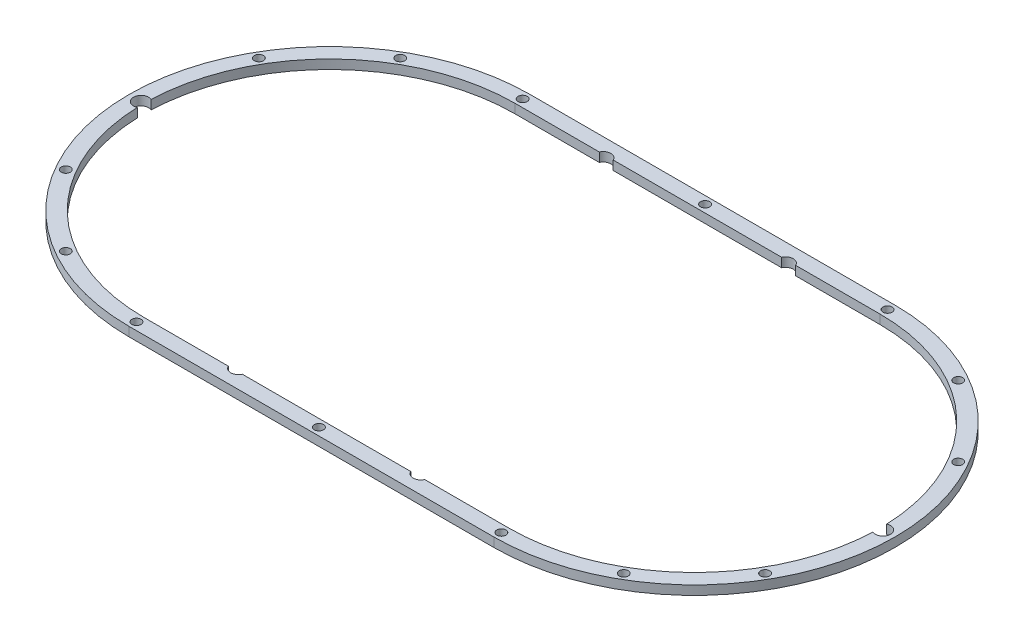
ISO-10303-21;
HEADER;
FILE_DESCRIPTION(('STEP AP214'),'2;1');
FILE_NAME('part.step','',(''),(''),'','','');
FILE_SCHEMA(('AUTOMOTIVE_DESIGN { 1 0 10303 214 1 1 1 1 }'));
ENDSEC;
DATA;
#1=APPLICATION_CONTEXT('core data for automotive mechanical design processes');
#2=APPLICATION_PROTOCOL_DEFINITION('international standard','automotive_design',2000,#1);
#3=PRODUCT_CONTEXT('',#1,'mechanical');
#4=PRODUCT('Part','Part','',(#3));
#5=PRODUCT_RELATED_PRODUCT_CATEGORY('part','',(#4));
#6=PRODUCT_DEFINITION_FORMATION('','',#4);
#7=PRODUCT_DEFINITION_CONTEXT('part definition',#1,'design');
#8=PRODUCT_DEFINITION('design','',#6,#7);
#9=PRODUCT_DEFINITION_SHAPE('','',#8);
#10=(LENGTH_UNIT() NAMED_UNIT(*) SI_UNIT(.MILLI.,.METRE.));
#11=(NAMED_UNIT(*) PLANE_ANGLE_UNIT() SI_UNIT($,.RADIAN.));
#12=(NAMED_UNIT(*) SI_UNIT($,.STERADIAN.) SOLID_ANGLE_UNIT());
#13=UNCERTAINTY_MEASURE_WITH_UNIT(LENGTH_MEASURE(1.E-05),#10,'distance_accuracy_value','');
#14=(GEOMETRIC_REPRESENTATION_CONTEXT(3) GLOBAL_UNCERTAINTY_ASSIGNED_CONTEXT((#13)) GLOBAL_UNIT_ASSIGNED_CONTEXT((#10,
#11,#12)) REPRESENTATION_CONTEXT('',''));
#15=CARTESIAN_POINT('',(0.,0.,0.));
#16=DIRECTION('',(0.,0.,1.));
#17=DIRECTION('',(1.,0.,0.));
#18=AXIS2_PLACEMENT_3D('',#15,#16,#17);
#19=CARTESIAN_POINT('',(0.,3.,0.));
#20=DIRECTION('',(0.,1.,0.));
#21=DIRECTION('',(0.,0.,1.));
#22=AXIS2_PLACEMENT_3D('',#19,#20,#21);
#23=PLANE('',#22);
#24=CARTESIAN_POINT('',(-30.,3.,-60.));
#25=DIRECTION('',(0.,1.,0.));
#26=DIRECTION('',(0.,0.,1.));
#27=AXIS2_PLACEMENT_3D('',#24,#25,#26);
#28=CIRCLE('',#27,2.5);
#29=CARTESIAN_POINT('',(-27.7087121525221,3.,-61.));
#30=VERTEX_POINT('',#29);
#31=CARTESIAN_POINT('',(-32.2912878474779,3.,-61.));
#32=VERTEX_POINT('',#31);
#33=EDGE_CURVE('E58',#30,#32,#28,.T.);
#34=ORIENTED_EDGE('',*,*,#33,.F.);
#35=DIRECTION('',(-1.,0.,0.));
#36=VECTOR('',#35,1.);
#37=CARTESIAN_POINT('',(27.7087121525221,3.,-61.));
#38=LINE('',#37,#36);
#39=CARTESIAN_POINT('',(27.7087121525221,3.,-61.));
#40=VERTEX_POINT('',#39);
#41=EDGE_CURVE('E252',#40,#30,#38,.T.);
#42=ORIENTED_EDGE('',*,*,#41,.F.);
#43=CARTESIAN_POINT('',(30.,3.,-60.));
#44=DIRECTION('',(0.,1.,0.));
#45=DIRECTION('',(0.,0.,1.));
#46=AXIS2_PLACEMENT_3D('',#43,#44,#45);
#47=CIRCLE('',#46,2.5);
#48=CARTESIAN_POINT('',(32.2912878474779,3.,-61.));
#49=VERTEX_POINT('',#48);
#50=EDGE_CURVE('E248',#49,#40,#47,.T.);
#51=ORIENTED_EDGE('',*,*,#50,.F.);
#52=DIRECTION('',(-1.,0.,0.));
#53=VECTOR('',#52,1.);
#54=CARTESIAN_POINT('',(60.,3.,-61.));
#55=LINE('',#54,#53);
#56=CARTESIAN_POINT('',(60.,3.,-61.));
#57=VERTEX_POINT('',#56);
#58=EDGE_CURVE('E244',#57,#49,#55,.T.);
#59=ORIENTED_EDGE('',*,*,#58,.F.);
#60=CARTESIAN_POINT('',(60.,3.,0.));
#61=DIRECTION('',(0.,1.,0.));
#62=DIRECTION('',(0.,0.,1.));
#63=AXIS2_PLACEMENT_3D('',#60,#61,#62);
#64=CIRCLE('',#63,61.);
#65=CARTESIAN_POINT('',(120.957661290323,3.,-2.27234020655112));
#66=VERTEX_POINT('',#65);
#67=EDGE_CURVE('E240',#66,#57,#64,.T.);
#68=ORIENTED_EDGE('',*,*,#67,.F.);
#69=CARTESIAN_POINT('',(122.,3.,0.));
#70=DIRECTION('',(0.,1.,0.));
#71=DIRECTION('',(0.,0.,1.));
#72=AXIS2_PLACEMENT_3D('',#69,#70,#71);
#73=CIRCLE('',#72,2.50000000000016);
#74=CARTESIAN_POINT('',(120.957661290323,3.,2.27234020655112));
#75=VERTEX_POINT('',#74);
#76=EDGE_CURVE('E236',#75,#66,#73,.T.);
#77=ORIENTED_EDGE('',*,*,#76,.F.);
#78=CARTESIAN_POINT('',(60.,3.,0.));
#79=DIRECTION('',(0.,1.,0.));
#80=DIRECTION('',(0.,0.,1.));
#81=AXIS2_PLACEMENT_3D('',#78,#79,#80);
#82=CIRCLE('',#81,61.);
#83=CARTESIAN_POINT('',(60.,3.,61.));
#84=VERTEX_POINT('',#83);
#85=EDGE_CURVE('E232',#84,#75,#82,.T.);
#86=ORIENTED_EDGE('',*,*,#85,.F.);
#87=DIRECTION('',(1.,0.,0.));
#88=VECTOR('',#87,1.);
#89=CARTESIAN_POINT('',(32.2912878474779,3.,61.));
#90=LINE('',#89,#88);
#91=CARTESIAN_POINT('',(32.2912878474779,3.,61.));
#92=VERTEX_POINT('',#91);
#93=EDGE_CURVE('E228',#92,#84,#90,.T.);
#94=ORIENTED_EDGE('',*,*,#93,.F.);
#95=CARTESIAN_POINT('',(30.,3.,60.));
#96=DIRECTION('',(0.,1.,0.));
#97=DIRECTION('',(0.,0.,1.));
#98=AXIS2_PLACEMENT_3D('',#95,#96,#97);
#99=CIRCLE('',#98,2.5);
#100=CARTESIAN_POINT('',(27.7087121525221,3.,61.));
#101=VERTEX_POINT('',#100);
#102=EDGE_CURVE('E224',#101,#92,#99,.T.);
#103=ORIENTED_EDGE('',*,*,#102,.F.);
#104=DIRECTION('',(1.,0.,0.));
#105=VECTOR('',#104,1.);
#106=CARTESIAN_POINT('',(-27.7087121525221,3.,61.));
#107=LINE('',#106,#105);
#108=CARTESIAN_POINT('',(-27.7087121525221,3.,61.));
#109=VERTEX_POINT('',#108);
#110=EDGE_CURVE('E220',#109,#101,#107,.T.);
#111=ORIENTED_EDGE('',*,*,#110,.F.);
#112=CARTESIAN_POINT('',(-30.,3.,60.));
#113=DIRECTION('',(0.,1.,0.));
#114=DIRECTION('',(0.,0.,1.));
#115=AXIS2_PLACEMENT_3D('',#112,#113,#114);
#116=CIRCLE('',#115,2.5);
#117=CARTESIAN_POINT('',(-32.2912878474779,3.,61.));
#118=VERTEX_POINT('',#117);
#119=EDGE_CURVE('E216',#118,#109,#116,.T.);
#120=ORIENTED_EDGE('',*,*,#119,.F.);
#121=DIRECTION('',(1.,0.,0.));
#122=VECTOR('',#121,1.);
#123=CARTESIAN_POINT('',(-60.,3.,61.));
#124=LINE('',#123,#122);
#125=CARTESIAN_POINT('',(-60.,3.,61.));
#126=VERTEX_POINT('',#125);
#127=EDGE_CURVE('E212',#126,#118,#124,.T.);
#128=ORIENTED_EDGE('',*,*,#127,.F.);
#129=CARTESIAN_POINT('',(-60.,3.,0.));
#130=DIRECTION('',(0.,1.,0.));
#131=DIRECTION('',(0.,0.,1.));
#132=AXIS2_PLACEMENT_3D('',#129,#130,#131);
#133=CIRCLE('',#132,61.);
#134=CARTESIAN_POINT('',(-120.957661290323,3.,2.2723402065511));
#135=VERTEX_POINT('',#134);
#136=EDGE_CURVE('E205',#135,#126,#133,.T.);
#137=ORIENTED_EDGE('',*,*,#136,.F.);
#138=CARTESIAN_POINT('',(-122.,3.,0.));
#139=DIRECTION('',(0.,1.,0.));
#140=DIRECTION('',(0.,0.,1.));
#141=AXIS2_PLACEMENT_3D('',#138,#139,#140);
#142=CIRCLE('',#141,2.50000000000016);
#143=CARTESIAN_POINT('',(-120.957661290323,3.,-2.27234020655112));
#144=VERTEX_POINT('',#143);
#145=EDGE_CURVE('E201',#144,#135,#142,.T.);
#146=ORIENTED_EDGE('',*,*,#145,.F.);
#147=CARTESIAN_POINT('',(-60.,3.,0.));
#148=DIRECTION('',(0.,1.,0.));
#149=DIRECTION('',(0.,0.,1.));
#150=AXIS2_PLACEMENT_3D('',#147,#148,#149);
#151=CIRCLE('',#150,61.);
#152=CARTESIAN_POINT('',(-60.,3.,-61.));
#153=VERTEX_POINT('',#152);
#154=EDGE_CURVE('E183',#153,#144,#151,.T.);
#155=ORIENTED_EDGE('',*,*,#154,.F.);
#156=DIRECTION('',(-1.,0.,0.));
#157=VECTOR('',#156,1.);
#158=CARTESIAN_POINT('',(-32.2912878474779,3.,-61.));
#159=LINE('',#158,#157);
#160=EDGE_CURVE('E193',#32,#153,#159,.T.);
#161=ORIENTED_EDGE('',*,*,#160,.F.);
#162=EDGE_LOOP('',(#34,#42,#51,#59,#68,#77,#86,#94,#103,#111,#120,#128,#137,#146,#155,#161));
#163=FACE_BOUND('',#162,.T.);
#164=CARTESIAN_POINT('',(91.7500000000002,3.,-54.9926131403117));
#165=DIRECTION('',(0.,1.,0.));
#166=DIRECTION('',(0.,0.,1.));
#167=AXIS2_PLACEMENT_3D('',#164,#165,#166);
#168=CIRCLE('',#167,1.5);
#169=CARTESIAN_POINT('',(91.7500000000002,3.,-53.4926131403117));
#170=VERTEX_POINT('',#169);
#171=EDGE_CURVE('E325',#170,#170,#168,.T.);
#172=ORIENTED_EDGE('',*,*,#171,.F.);
#173=EDGE_LOOP('',(#172));
#174=FACE_BOUND('',#173,.T.);
#175=CARTESIAN_POINT('',(60.,3.,-63.4999999999999));
#176=DIRECTION('',(0.,1.,0.));
#177=DIRECTION('',(0.,0.,1.));
#178=AXIS2_PLACEMENT_3D('',#175,#176,#177);
#179=CIRCLE('',#178,1.5);
#180=CARTESIAN_POINT('',(60.,3.,-61.9999999999999));
#181=VERTEX_POINT('',#180);
#182=EDGE_CURVE('E320',#181,#181,#179,.T.);
#183=ORIENTED_EDGE('',*,*,#182,.F.);
#184=EDGE_LOOP('',(#183));
#185=FACE_BOUND('',#184,.T.);
#186=CARTESIAN_POINT('',(114.992613140312,3.,-31.7499999999997));
#187=DIRECTION('',(0.,1.,0.));
#188=DIRECTION('',(0.,0.,1.));
#189=AXIS2_PLACEMENT_3D('',#186,#187,#188);
#190=CIRCLE('',#189,1.5);
#191=CARTESIAN_POINT('',(114.992613140312,3.,-30.2499999999997));
#192=VERTEX_POINT('',#191);
#193=EDGE_CURVE('E324',#192,#192,#190,.T.);
#194=ORIENTED_EDGE('',*,*,#193,.F.);
#195=EDGE_LOOP('',(#194));
#196=FACE_BOUND('',#195,.T.);
#197=CARTESIAN_POINT('',(0.,3.,-63.4999999999999));
#198=DIRECTION('',(0.,1.,0.));
#199=DIRECTION('',(0.,0.,1.));
#200=AXIS2_PLACEMENT_3D('',#197,#198,#199);
#201=CIRCLE('',#200,1.5);
#202=CARTESIAN_POINT('',(0.,3.,-61.9999999999999));
#203=VERTEX_POINT('',#202);
#204=EDGE_CURVE('E330',#203,#203,#201,.T.);
#205=ORIENTED_EDGE('',*,*,#204,.F.);
#206=EDGE_LOOP('',(#205));
#207=FACE_BOUND('',#206,.T.);
#208=CARTESIAN_POINT('',(91.7500000000002,3.,54.9926131403117));
#209=DIRECTION('',(0.,1.,0.));
#210=DIRECTION('',(0.,0.,-1.));
#211=AXIS2_PLACEMENT_3D('',#208,#209,#210);
#212=CIRCLE('',#211,1.5);
#213=CARTESIAN_POINT('',(91.7500000000002,3.,53.4926131403117));
#214=VERTEX_POINT('',#213);
#215=EDGE_CURVE('E329',#214,#214,#212,.T.);
#216=ORIENTED_EDGE('',*,*,#215,.F.);
#217=EDGE_LOOP('',(#216));
#218=FACE_BOUND('',#217,.T.);
#219=CARTESIAN_POINT('',(114.992613140312,3.,31.7499999999997));
#220=DIRECTION('',(0.,1.,0.));
#221=DIRECTION('',(0.,0.,-1.));
#222=AXIS2_PLACEMENT_3D('',#219,#220,#221);
#223=CIRCLE('',#222,1.5);
#224=CARTESIAN_POINT('',(114.992613140312,3.,30.2499999999997));
#225=VERTEX_POINT('',#224);
#226=EDGE_CURVE('E341',#225,#225,#223,.T.);
#227=ORIENTED_EDGE('',*,*,#226,.F.);
#228=EDGE_LOOP('',(#227));
#229=FACE_BOUND('',#228,.T.);
#230=CARTESIAN_POINT('',(-91.7500000000002,3.,54.9926131403117));
#231=DIRECTION('',(0.,1.,0.));
#232=DIRECTION('',(0.,0.,1.));
#233=AXIS2_PLACEMENT_3D('',#230,#231,#232);
#234=CIRCLE('',#233,1.5);
#235=CARTESIAN_POINT('',(-91.7500000000002,3.,56.4926131403117));
#236=VERTEX_POINT('',#235);
#237=EDGE_CURVE('E345',#236,#236,#234,.T.);
#238=ORIENTED_EDGE('',*,*,#237,.F.);
#239=EDGE_LOOP('',(#238));
#240=FACE_BOUND('',#239,.T.);
#241=CARTESIAN_POINT('',(-114.992613140312,3.,31.7499999999997));
#242=DIRECTION('',(0.,1.,0.));
#243=DIRECTION('',(0.,0.,1.));
#244=AXIS2_PLACEMENT_3D('',#241,#242,#243);
#245=CIRCLE('',#244,1.5);
#246=CARTESIAN_POINT('',(-114.992613140312,3.,33.2499999999997));
#247=VERTEX_POINT('',#246);
#248=EDGE_CURVE('E308',#247,#247,#245,.T.);
#249=ORIENTED_EDGE('',*,*,#248,.F.);
#250=EDGE_LOOP('',(#249));
#251=FACE_BOUND('',#250,.T.);
#252=CARTESIAN_POINT('',(-60.,3.,63.4999999999999));
#253=DIRECTION('',(0.,1.,0.));
#254=DIRECTION('',(0.,0.,-1.));
#255=AXIS2_PLACEMENT_3D('',#252,#253,#254);
#256=CIRCLE('',#255,1.5);
#257=CARTESIAN_POINT('',(-60.,3.,61.9999999999999));
#258=VERTEX_POINT('',#257);
#259=EDGE_CURVE('E259',#258,#258,#256,.T.);
#260=ORIENTED_EDGE('',*,*,#259,.F.);
#261=EDGE_LOOP('',(#260));
#262=FACE_BOUND('',#261,.T.);
#263=CARTESIAN_POINT('',(0.,3.,63.4999999999999));
#264=DIRECTION('',(0.,1.,0.));
#265=DIRECTION('',(0.,0.,-1.));
#266=AXIS2_PLACEMENT_3D('',#263,#264,#265);
#267=CIRCLE('',#266,1.5);
#268=CARTESIAN_POINT('',(0.,3.,61.9999999999999));
#269=VERTEX_POINT('',#268);
#270=EDGE_CURVE('E303',#269,#269,#267,.T.);
#271=ORIENTED_EDGE('',*,*,#270,.F.);
#272=EDGE_LOOP('',(#271));
#273=FACE_BOUND('',#272,.T.);
#274=CARTESIAN_POINT('',(60.,3.,63.4999999999999));
#275=DIRECTION('',(0.,1.,0.));
#276=DIRECTION('',(0.,0.,-1.));
#277=AXIS2_PLACEMENT_3D('',#274,#275,#276);
#278=CIRCLE('',#277,1.5);
#279=CARTESIAN_POINT('',(60.,3.,61.9999999999999));
#280=VERTEX_POINT('',#279);
#281=EDGE_CURVE('E313',#280,#280,#278,.T.);
#282=ORIENTED_EDGE('',*,*,#281,.F.);
#283=EDGE_LOOP('',(#282));
#284=FACE_BOUND('',#283,.T.);
#285=CARTESIAN_POINT('',(-114.992613140312,3.,-31.7499999999997));
#286=DIRECTION('',(0.,1.,0.));
#287=DIRECTION('',(0.,0.,-1.));
#288=AXIS2_PLACEMENT_3D('',#285,#286,#287);
#289=CIRCLE('',#288,1.5);
#290=CARTESIAN_POINT('',(-114.992613140312,3.,-33.2499999999997));
#291=VERTEX_POINT('',#290);
#292=EDGE_CURVE('E309',#291,#291,#289,.T.);
#293=ORIENTED_EDGE('',*,*,#292,.F.);
#294=EDGE_LOOP('',(#293));
#295=FACE_BOUND('',#294,.T.);
#296=CARTESIAN_POINT('',(-91.7500000000002,3.,-54.9926131403117));
#297=DIRECTION('',(0.,1.,0.));
#298=DIRECTION('',(0.,0.,-1.));
#299=AXIS2_PLACEMENT_3D('',#296,#297,#298);
#300=CIRCLE('',#299,1.5);
#301=CARTESIAN_POINT('',(-91.7500000000002,3.,-56.4926131403117));
#302=VERTEX_POINT('',#301);
#303=EDGE_CURVE('E304',#302,#302,#300,.T.);
#304=ORIENTED_EDGE('',*,*,#303,.F.);
#305=EDGE_LOOP('',(#304));
#306=FACE_BOUND('',#305,.T.);
#307=CARTESIAN_POINT('',(-60.,3.,-63.4999999999999));
#308=DIRECTION('',(0.,1.,0.));
#309=DIRECTION('',(0.,0.,1.));
#310=AXIS2_PLACEMENT_3D('',#307,#308,#309);
#311=CIRCLE('',#310,1.5);
#312=CARTESIAN_POINT('',(-60.,3.,-61.9999999999999));
#313=VERTEX_POINT('',#312);
#314=EDGE_CURVE('E334',#313,#313,#311,.T.);
#315=ORIENTED_EDGE('',*,*,#314,.F.);
#316=EDGE_LOOP('',(#315));
#317=FACE_BOUND('',#316,.T.);
#318=DIRECTION('',(-1.,0.,0.));
#319=VECTOR('',#318,1.);
#320=CARTESIAN_POINT('',(60.,3.,-66.));
#321=LINE('',#320,#319);
#322=CARTESIAN_POINT('',(60.,3.,-66.));
#323=VERTEX_POINT('',#322);
#324=CARTESIAN_POINT('',(-60.,3.,-66.));
#325=VERTEX_POINT('',#324);
#326=EDGE_CURVE('E369',#323,#325,#321,.T.);
#327=ORIENTED_EDGE('',*,*,#326,.T.);
#328=CARTESIAN_POINT('',(-60.,3.,0.));
#329=DIRECTION('',(0.,1.,0.));
#330=DIRECTION('',(0.,0.,1.));
#331=AXIS2_PLACEMENT_3D('',#328,#329,#330);
#332=CIRCLE('',#331,66.);
#333=CARTESIAN_POINT('',(-60.,3.,66.));
#334=VERTEX_POINT('',#333);
#335=EDGE_CURVE('E356',#325,#334,#332,.T.);
#336=ORIENTED_EDGE('',*,*,#335,.T.);
#337=DIRECTION('',(1.,0.,0.));
#338=VECTOR('',#337,1.);
#339=CARTESIAN_POINT('',(-60.,3.,66.));
#340=LINE('',#339,#338);
#341=CARTESIAN_POINT('',(60.,3.,66.));
#342=VERTEX_POINT('',#341);
#343=EDGE_CURVE('E360',#334,#342,#340,.T.);
#344=ORIENTED_EDGE('',*,*,#343,.T.);
#345=CARTESIAN_POINT('',(60.,3.,0.));
#346=DIRECTION('',(0.,1.,0.));
#347=DIRECTION('',(0.,0.,1.));
#348=AXIS2_PLACEMENT_3D('',#345,#346,#347);
#349=CIRCLE('',#348,66.);
#350=EDGE_CURVE('E365',#342,#323,#349,.T.);
#351=ORIENTED_EDGE('',*,*,#350,.T.);
#352=EDGE_LOOP('',(#327,#336,#344,#351));
#353=FACE_BOUND('',#352,.T.);
#354=ADVANCED_FACE('F42',(#163,#174,#185,#196,#207,#218,#229,#240,#251,#262,#273,#284,#295,#306,
#317,#353),#23,.T.);
#355=CARTESIAN_POINT('',(0.,0.,0.));
#356=DIRECTION('',(0.,1.,0.));
#357=DIRECTION('',(0.,0.,1.));
#358=AXIS2_PLACEMENT_3D('',#355,#356,#357);
#359=PLANE('',#358);
#360=DIRECTION('',(-1.,0.,0.));
#361=VECTOR('',#360,1.);
#362=CARTESIAN_POINT('',(0.,0.,-61.));
#363=LINE('',#362,#361);
#364=CARTESIAN_POINT('',(27.7087121525221,0.,-61.));
#365=VERTEX_POINT('',#364);
#366=CARTESIAN_POINT('',(-27.7087121525221,0.,-61.));
#367=VERTEX_POINT('',#366);
#368=EDGE_CURVE('E51',#365,#367,#363,.T.);
#369=ORIENTED_EDGE('',*,*,#368,.T.);
#370=CARTESIAN_POINT('',(-30.,0.,-60.));
#371=DIRECTION('',(0.,1.,0.));
#372=DIRECTION('',(0.,0.,1.));
#373=AXIS2_PLACEMENT_3D('',#370,#371,#372);
#374=CIRCLE('',#373,2.5);
#375=CARTESIAN_POINT('',(-32.2912878474779,0.,-61.));
#376=VERTEX_POINT('',#375);
#377=EDGE_CURVE('E11',#367,#376,#374,.T.);
#378=ORIENTED_EDGE('',*,*,#377,.T.);
#379=DIRECTION('',(-1.,0.,0.));
#380=VECTOR('',#379,1.);
#381=CARTESIAN_POINT('',(0.,0.,-61.));
#382=LINE('',#381,#380);
#383=CARTESIAN_POINT('',(-60.,0.,-61.));
#384=VERTEX_POINT('',#383);
#385=EDGE_CURVE('E399',#376,#384,#382,.T.);
#386=ORIENTED_EDGE('',*,*,#385,.T.);
#387=CARTESIAN_POINT('',(-60.,0.,0.));
#388=DIRECTION('',(0.,1.,0.));
#389=DIRECTION('',(0.,0.,1.));
#390=AXIS2_PLACEMENT_3D('',#387,#388,#389);
#391=CIRCLE('',#390,61.);
#392=CARTESIAN_POINT('',(-120.957661290323,0.,-2.27234020655112));
#393=VERTEX_POINT('',#392);
#394=EDGE_CURVE('E186',#384,#393,#391,.T.);
#395=ORIENTED_EDGE('',*,*,#394,.T.);
#396=CARTESIAN_POINT('',(-122.,0.,0.));
#397=DIRECTION('',(0.,1.,0.));
#398=DIRECTION('',(0.,0.,1.));
#399=AXIS2_PLACEMENT_3D('',#396,#397,#398);
#400=CIRCLE('',#399,2.50000000000016);
#401=CARTESIAN_POINT('',(-120.957661290323,0.,2.2723402065511));
#402=VERTEX_POINT('',#401);
#403=EDGE_CURVE('E458',#393,#402,#400,.T.);
#404=ORIENTED_EDGE('',*,*,#403,.T.);
#405=CARTESIAN_POINT('',(-60.,0.,0.));
#406=DIRECTION('',(0.,1.,0.));
#407=DIRECTION('',(0.,0.,1.));
#408=AXIS2_PLACEMENT_3D('',#405,#406,#407);
#409=CIRCLE('',#408,61.);
#410=CARTESIAN_POINT('',(-60.,0.,61.));
#411=VERTEX_POINT('',#410);
#412=EDGE_CURVE('E462',#402,#411,#409,.T.);
#413=ORIENTED_EDGE('',*,*,#412,.T.);
#414=DIRECTION('',(1.,0.,0.));
#415=VECTOR('',#414,1.);
#416=CARTESIAN_POINT('',(0.,0.,61.));
#417=LINE('',#416,#415);
#418=CARTESIAN_POINT('',(-32.2912878474779,0.,61.));
#419=VERTEX_POINT('',#418);
#420=EDGE_CURVE('E466',#411,#419,#417,.T.);
#421=ORIENTED_EDGE('',*,*,#420,.T.);
#422=CARTESIAN_POINT('',(-30.,0.,60.));
#423=DIRECTION('',(0.,1.,0.));
#424=DIRECTION('',(0.,0.,1.));
#425=AXIS2_PLACEMENT_3D('',#422,#423,#424);
#426=CIRCLE('',#425,2.5);
#427=CARTESIAN_POINT('',(-27.7087121525221,0.,61.));
#428=VERTEX_POINT('',#427);
#429=EDGE_CURVE('E470',#419,#428,#426,.T.);
#430=ORIENTED_EDGE('',*,*,#429,.T.);
#431=DIRECTION('',(1.,0.,0.));
#432=VECTOR('',#431,1.);
#433=CARTESIAN_POINT('',(0.,0.,61.));
#434=LINE('',#433,#432);
#435=CARTESIAN_POINT('',(27.7087121525221,0.,61.));
#436=VERTEX_POINT('',#435);
#437=EDGE_CURVE('E474',#428,#436,#434,.T.);
#438=ORIENTED_EDGE('',*,*,#437,.T.);
#439=CARTESIAN_POINT('',(30.,0.,60.));
#440=DIRECTION('',(0.,1.,0.));
#441=DIRECTION('',(0.,0.,1.));
#442=AXIS2_PLACEMENT_3D('',#439,#440,#441);
#443=CIRCLE('',#442,2.5);
#444=CARTESIAN_POINT('',(32.2912878474779,0.,61.));
#445=VERTEX_POINT('',#444);
#446=EDGE_CURVE('E478',#436,#445,#443,.T.);
#447=ORIENTED_EDGE('',*,*,#446,.T.);
#448=DIRECTION('',(1.,0.,0.));
#449=VECTOR('',#448,1.);
#450=CARTESIAN_POINT('',(0.,0.,61.));
#451=LINE('',#450,#449);
#452=CARTESIAN_POINT('',(60.,0.,61.));
#453=VERTEX_POINT('',#452);
#454=EDGE_CURVE('E482',#445,#453,#451,.T.);
#455=ORIENTED_EDGE('',*,*,#454,.T.);
#456=CARTESIAN_POINT('',(60.,0.,0.));
#457=DIRECTION('',(0.,1.,0.));
#458=DIRECTION('',(0.,0.,1.));
#459=AXIS2_PLACEMENT_3D('',#456,#457,#458);
#460=CIRCLE('',#459,61.);
#461=CARTESIAN_POINT('',(120.957661290323,0.,2.27234020655112));
#462=VERTEX_POINT('',#461);
#463=EDGE_CURVE('E486',#453,#462,#460,.T.);
#464=ORIENTED_EDGE('',*,*,#463,.T.);
#465=CARTESIAN_POINT('',(122.,0.,0.));
#466=DIRECTION('',(0.,1.,0.));
#467=DIRECTION('',(0.,0.,1.));
#468=AXIS2_PLACEMENT_3D('',#465,#466,#467);
#469=CIRCLE('',#468,2.50000000000016);
#470=CARTESIAN_POINT('',(120.957661290323,0.,-2.27234020655112));
#471=VERTEX_POINT('',#470);
#472=EDGE_CURVE('E490',#462,#471,#469,.T.);
#473=ORIENTED_EDGE('',*,*,#472,.T.);
#474=CARTESIAN_POINT('',(60.,0.,0.));
#475=DIRECTION('',(0.,1.,0.));
#476=DIRECTION('',(0.,0.,1.));
#477=AXIS2_PLACEMENT_3D('',#474,#475,#476);
#478=CIRCLE('',#477,61.);
#479=CARTESIAN_POINT('',(60.,0.,-61.));
#480=VERTEX_POINT('',#479);
#481=EDGE_CURVE('E494',#471,#480,#478,.T.);
#482=ORIENTED_EDGE('',*,*,#481,.T.);
#483=DIRECTION('',(-1.,0.,0.));
#484=VECTOR('',#483,1.);
#485=CARTESIAN_POINT('',(0.,0.,-61.));
#486=LINE('',#485,#484);
#487=CARTESIAN_POINT('',(32.2912878474779,0.,-61.));
#488=VERTEX_POINT('',#487);
#489=EDGE_CURVE('E498',#480,#488,#486,.T.);
#490=ORIENTED_EDGE('',*,*,#489,.T.);
#491=CARTESIAN_POINT('',(30.,0.,-60.));
#492=DIRECTION('',(0.,1.,0.));
#493=DIRECTION('',(0.,0.,1.));
#494=AXIS2_PLACEMENT_3D('',#491,#492,#493);
#495=CIRCLE('',#494,2.5);
#496=EDGE_CURVE('E502',#488,#365,#495,.T.);
#497=ORIENTED_EDGE('',*,*,#496,.T.);
#498=EDGE_LOOP('',(#369,#378,#386,#395,#404,#413,#421,#430,#438,#447,#455,#464,#473,#482,#490,#497));
#499=FACE_BOUND('',#498,.T.);
#500=CARTESIAN_POINT('',(91.7500000000002,0.,-54.9926131403117));
#501=DIRECTION('',(0.,1.,0.));
#502=DIRECTION('',(0.,0.,1.));
#503=AXIS2_PLACEMENT_3D('',#500,#501,#502);
#504=CIRCLE('',#503,1.5);
#505=CARTESIAN_POINT('',(91.7500000000002,0.,-53.4926131403117));
#506=VERTEX_POINT('',#505);
#507=EDGE_CURVE('E361',#506,#506,#504,.T.);
#508=ORIENTED_EDGE('',*,*,#507,.T.);
#509=EDGE_LOOP('',(#508));
#510=FACE_BOUND('',#509,.T.);
#511=CARTESIAN_POINT('',(60.,0.,-63.4999999999999));
#512=DIRECTION('',(0.,1.,0.));
#513=DIRECTION('',(0.,0.,1.));
#514=AXIS2_PLACEMENT_3D('',#511,#512,#513);
#515=CIRCLE('',#514,1.5);
#516=CARTESIAN_POINT('',(60.,0.,-61.9999999999999));
#517=VERTEX_POINT('',#516);
#518=EDGE_CURVE('E447',#517,#517,#515,.T.);
#519=ORIENTED_EDGE('',*,*,#518,.T.);
#520=EDGE_LOOP('',(#519));
#521=FACE_BOUND('',#520,.T.);
#522=CARTESIAN_POINT('',(114.992613140312,0.,-31.7499999999997));
#523=DIRECTION('',(0.,1.,0.));
#524=DIRECTION('',(0.,0.,1.));
#525=AXIS2_PLACEMENT_3D('',#522,#523,#524);
#526=CIRCLE('',#525,1.5);
#527=CARTESIAN_POINT('',(114.992613140312,0.,-30.2499999999997));
#528=VERTEX_POINT('',#527);
#529=EDGE_CURVE('E443',#528,#528,#526,.T.);
#530=ORIENTED_EDGE('',*,*,#529,.T.);
#531=EDGE_LOOP('',(#530));
#532=FACE_BOUND('',#531,.T.);
#533=CARTESIAN_POINT('',(0.,0.,-63.4999999999999));
#534=DIRECTION('',(0.,1.,0.));
#535=DIRECTION('',(0.,0.,1.));
#536=AXIS2_PLACEMENT_3D('',#533,#534,#535);
#537=CIRCLE('',#536,1.5);
#538=CARTESIAN_POINT('',(0.,0.,-61.9999999999999));
#539=VERTEX_POINT('',#538);
#540=EDGE_CURVE('E439',#539,#539,#537,.T.);
#541=ORIENTED_EDGE('',*,*,#540,.T.);
#542=EDGE_LOOP('',(#541));
#543=FACE_BOUND('',#542,.T.);
#544=CARTESIAN_POINT('',(91.7500000000002,0.,54.9926131403117));
#545=DIRECTION('',(0.,1.,0.));
#546=DIRECTION('',(0.,0.,1.));
#547=AXIS2_PLACEMENT_3D('',#544,#545,#546);
#548=CIRCLE('',#547,1.5);
#549=CARTESIAN_POINT('',(91.7500000000002,0.,56.4926131403117));
#550=VERTEX_POINT('',#549);
#551=EDGE_CURVE('E435',#550,#550,#548,.T.);
#552=ORIENTED_EDGE('',*,*,#551,.T.);
#553=EDGE_LOOP('',(#552));
#554=FACE_BOUND('',#553,.T.);
#555=CARTESIAN_POINT('',(114.992613140312,0.,31.7499999999997));
#556=DIRECTION('',(0.,1.,0.));
#557=DIRECTION('',(0.,0.,1.));
#558=AXIS2_PLACEMENT_3D('',#555,#556,#557);
#559=CIRCLE('',#558,1.5);
#560=CARTESIAN_POINT('',(114.992613140312,0.,33.2499999999997));
#561=VERTEX_POINT('',#560);
#562=EDGE_CURVE('E431',#561,#561,#559,.T.);
#563=ORIENTED_EDGE('',*,*,#562,.T.);
#564=EDGE_LOOP('',(#563));
#565=FACE_BOUND('',#564,.T.);
#566=CARTESIAN_POINT('',(-91.7500000000002,0.,54.9926131403117));
#567=DIRECTION('',(0.,1.,0.));
#568=DIRECTION('',(0.,0.,1.));
#569=AXIS2_PLACEMENT_3D('',#566,#567,#568);
#570=CIRCLE('',#569,1.5);
#571=CARTESIAN_POINT('',(-91.7500000000002,0.,56.4926131403117));
#572=VERTEX_POINT('',#571);
#573=EDGE_CURVE('E427',#572,#572,#570,.T.);
#574=ORIENTED_EDGE('',*,*,#573,.T.);
#575=EDGE_LOOP('',(#574));
#576=FACE_BOUND('',#575,.T.);
#577=CARTESIAN_POINT('',(-114.992613140312,0.,31.7499999999997));
#578=DIRECTION('',(0.,1.,0.));
#579=DIRECTION('',(0.,0.,1.));
#580=AXIS2_PLACEMENT_3D('',#577,#578,#579);
#581=CIRCLE('',#580,1.5);
#582=CARTESIAN_POINT('',(-114.992613140312,0.,33.2499999999997));
#583=VERTEX_POINT('',#582);
#584=EDGE_CURVE('E423',#583,#583,#581,.T.);
#585=ORIENTED_EDGE('',*,*,#584,.T.);
#586=EDGE_LOOP('',(#585));
#587=FACE_BOUND('',#586,.T.);
#588=CARTESIAN_POINT('',(-60.,0.,63.4999999999999));
#589=DIRECTION('',(0.,1.,0.));
#590=DIRECTION('',(0.,0.,1.));
#591=AXIS2_PLACEMENT_3D('',#588,#589,#590);
#592=CIRCLE('',#591,1.5);
#593=CARTESIAN_POINT('',(-60.,0.,64.9999999999999));
#594=VERTEX_POINT('',#593);
#595=EDGE_CURVE('E419',#594,#594,#592,.T.);
#596=ORIENTED_EDGE('',*,*,#595,.T.);
#597=EDGE_LOOP('',(#596));
#598=FACE_BOUND('',#597,.T.);
#599=CARTESIAN_POINT('',(0.,0.,63.4999999999999));
#600=DIRECTION('',(0.,1.,0.));
#601=DIRECTION('',(0.,0.,1.));
#602=AXIS2_PLACEMENT_3D('',#599,#600,#601);
#603=CIRCLE('',#602,1.5);
#604=CARTESIAN_POINT('',(0.,0.,64.9999999999999));
#605=VERTEX_POINT('',#604);
#606=EDGE_CURVE('E415',#605,#605,#603,.T.);
#607=ORIENTED_EDGE('',*,*,#606,.T.);
#608=EDGE_LOOP('',(#607));
#609=FACE_BOUND('',#608,.T.);
#610=CARTESIAN_POINT('',(60.,0.,63.4999999999999));
#611=DIRECTION('',(0.,1.,0.));
#612=DIRECTION('',(0.,0.,1.));
#613=AXIS2_PLACEMENT_3D('',#610,#611,#612);
#614=CIRCLE('',#613,1.5);
#615=CARTESIAN_POINT('',(60.,0.,64.9999999999999));
#616=VERTEX_POINT('',#615);
#617=EDGE_CURVE('E411',#616,#616,#614,.T.);
#618=ORIENTED_EDGE('',*,*,#617,.T.);
#619=EDGE_LOOP('',(#618));
#620=FACE_BOUND('',#619,.T.);
#621=CARTESIAN_POINT('',(-114.992613140312,0.,-31.7499999999997));
#622=DIRECTION('',(0.,1.,0.));
#623=DIRECTION('',(0.,0.,1.));
#624=AXIS2_PLACEMENT_3D('',#621,#622,#623);
#625=CIRCLE('',#624,1.5);
#626=CARTESIAN_POINT('',(-114.992613140312,0.,-30.2499999999997));
#627=VERTEX_POINT('',#626);
#628=EDGE_CURVE('E407',#627,#627,#625,.T.);
#629=ORIENTED_EDGE('',*,*,#628,.T.);
#630=EDGE_LOOP('',(#629));
#631=FACE_BOUND('',#630,.T.);
#632=CARTESIAN_POINT('',(-91.7500000000002,0.,-54.9926131403117));
#633=DIRECTION('',(0.,1.,0.));
#634=DIRECTION('',(0.,0.,1.));
#635=AXIS2_PLACEMENT_3D('',#632,#633,#634);
#636=CIRCLE('',#635,1.5);
#637=CARTESIAN_POINT('',(-91.7500000000002,0.,-53.4926131403117));
#638=VERTEX_POINT('',#637);
#639=EDGE_CURVE('E403',#638,#638,#636,.T.);
#640=ORIENTED_EDGE('',*,*,#639,.T.);
#641=EDGE_LOOP('',(#640));
#642=FACE_BOUND('',#641,.T.);
#643=CARTESIAN_POINT('',(-60.,0.,-63.4999999999999));
#644=DIRECTION('',(0.,1.,0.));
#645=DIRECTION('',(0.,0.,1.));
#646=AXIS2_PLACEMENT_3D('',#643,#644,#645);
#647=CIRCLE('',#646,1.5);
#648=CARTESIAN_POINT('',(-60.,0.,-61.9999999999999));
#649=VERTEX_POINT('',#648);
#650=EDGE_CURVE('E355',#649,#649,#647,.T.);
#651=ORIENTED_EDGE('',*,*,#650,.T.);
#652=EDGE_LOOP('',(#651));
#653=FACE_BOUND('',#652,.T.);
#654=CARTESIAN_POINT('',(-60.,0.,0.));
#655=DIRECTION('',(0.,1.,0.));
#656=DIRECTION('',(0.,0.,1.));
#657=AXIS2_PLACEMENT_3D('',#654,#655,#656);
#658=CIRCLE('',#657,66.);
#659=CARTESIAN_POINT('',(-60.,0.,-66.));
#660=VERTEX_POINT('',#659);
#661=CARTESIAN_POINT('',(-60.,0.,66.));
#662=VERTEX_POINT('',#661);
#663=EDGE_CURVE('E395',#660,#662,#658,.T.);
#664=ORIENTED_EDGE('',*,*,#663,.F.);
#665=DIRECTION('',(-1.,0.,0.));
#666=VECTOR('',#665,1.);
#667=CARTESIAN_POINT('',(0.,0.,-66.));
#668=LINE('',#667,#666);
#669=CARTESIAN_POINT('',(60.,0.,-66.));
#670=VERTEX_POINT('',#669);
#671=EDGE_CURVE('E392',#670,#660,#668,.T.);
#672=ORIENTED_EDGE('',*,*,#671,.F.);
#673=CARTESIAN_POINT('',(60.,0.,0.));
#674=DIRECTION('',(0.,1.,0.));
#675=DIRECTION('',(0.,0.,1.));
#676=AXIS2_PLACEMENT_3D('',#673,#674,#675);
#677=CIRCLE('',#676,66.);
#678=CARTESIAN_POINT('',(60.,0.,66.));
#679=VERTEX_POINT('',#678);
#680=EDGE_CURVE('E389',#679,#670,#677,.T.);
#681=ORIENTED_EDGE('',*,*,#680,.F.);
#682=DIRECTION('',(1.,0.,0.));
#683=VECTOR('',#682,1.);
#684=CARTESIAN_POINT('',(0.,0.,66.));
#685=LINE('',#684,#683);
#686=EDGE_CURVE('E377',#662,#679,#685,.T.);
#687=ORIENTED_EDGE('',*,*,#686,.F.);
#688=EDGE_LOOP('',(#664,#672,#681,#687));
#689=FACE_BOUND('',#688,.T.);
#690=ADVANCED_FACE('F44',(#499,#510,#521,#532,#543,#554,#565,#576,#587,#598,#609,#620,#631,#642,
#653,#689),#359,.F.);
#691=CARTESIAN_POINT('',(-60.,-7.,0.));
#692=DIRECTION('',(0.,1.,0.));
#693=DIRECTION('',(0.,0.,1.));
#694=AXIS2_PLACEMENT_3D('',#691,#692,#693);
#695=CYLINDRICAL_SURFACE('',#694,66.);
#696=ORIENTED_EDGE('',*,*,#663,.T.);
#697=DIRECTION('',(0.,1.,0.));
#698=VECTOR('',#697,1.);
#699=CARTESIAN_POINT('',(-60.,-7.,66.));
#700=LINE('',#699,#698);
#701=EDGE_CURVE('E373',#662,#334,#700,.T.);
#702=ORIENTED_EDGE('',*,*,#701,.T.);
#703=ORIENTED_EDGE('',*,*,#335,.F.);
#704=DIRECTION('',(0.,1.,0.));
#705=VECTOR('',#704,1.);
#706=CARTESIAN_POINT('',(-60.,-7.,-66.));
#707=LINE('',#706,#705);
#708=EDGE_CURVE('E374',#660,#325,#707,.T.);
#709=ORIENTED_EDGE('',*,*,#708,.F.);
#710=EDGE_LOOP('',(#696,#702,#703,#709));
#711=FACE_BOUND('',#710,.T.);
#712=ADVANCED_FACE('F579',(#711),#695,.T.);
#713=CARTESIAN_POINT('',(60.,-7.,-66.));
#714=DIRECTION('',(0.,0.,-1.));
#715=DIRECTION('',(-1.,0.,0.));
#716=AXIS2_PLACEMENT_3D('',#713,#714,#715);
#717=PLANE('',#716);
#718=ORIENTED_EDGE('',*,*,#671,.T.);
#719=ORIENTED_EDGE('',*,*,#708,.T.);
#720=ORIENTED_EDGE('',*,*,#326,.F.);
#721=DIRECTION('',(0.,1.,0.));
#722=VECTOR('',#721,1.);
#723=CARTESIAN_POINT('',(60.,-7.,-66.));
#724=LINE('',#723,#722);
#725=EDGE_CURVE('E378',#670,#323,#724,.T.);
#726=ORIENTED_EDGE('',*,*,#725,.F.);
#727=EDGE_LOOP('',(#718,#719,#720,#726));
#728=FACE_BOUND('',#727,.T.);
#729=ADVANCED_FACE('F583',(#728),#717,.T.);
#730=CARTESIAN_POINT('',(60.,-7.,0.));
#731=DIRECTION('',(0.,1.,0.));
#732=DIRECTION('',(0.,0.,1.));
#733=AXIS2_PLACEMENT_3D('',#730,#731,#732);
#734=CYLINDRICAL_SURFACE('',#733,66.);
#735=ORIENTED_EDGE('',*,*,#680,.T.);
#736=ORIENTED_EDGE('',*,*,#725,.T.);
#737=ORIENTED_EDGE('',*,*,#350,.F.);
#738=DIRECTION('',(0.,1.,0.));
#739=VECTOR('',#738,1.);
#740=CARTESIAN_POINT('',(60.,-7.,66.));
#741=LINE('',#740,#739);
#742=EDGE_CURVE('E381',#679,#342,#741,.T.);
#743=ORIENTED_EDGE('',*,*,#742,.F.);
#744=EDGE_LOOP('',(#735,#736,#737,#743));
#745=FACE_BOUND('',#744,.T.);
#746=ADVANCED_FACE('F589',(#745),#734,.T.);
#747=CARTESIAN_POINT('',(-60.,-7.,66.));
#748=DIRECTION('',(0.,0.,1.));
#749=DIRECTION('',(1.,0.,0.));
#750=AXIS2_PLACEMENT_3D('',#747,#748,#749);
#751=PLANE('',#750);
#752=ORIENTED_EDGE('',*,*,#686,.T.);
#753=ORIENTED_EDGE('',*,*,#742,.T.);
#754=ORIENTED_EDGE('',*,*,#343,.F.);
#755=ORIENTED_EDGE('',*,*,#701,.F.);
#756=EDGE_LOOP('',(#752,#753,#754,#755));
#757=FACE_BOUND('',#756,.T.);
#758=ADVANCED_FACE('F585',(#757),#751,.T.);
#759=CARTESIAN_POINT('',(-60.,-7.,-63.4999999999999));
#760=DIRECTION('',(0.,1.,0.));
#761=DIRECTION('',(0.,0.,1.));
#762=AXIS2_PLACEMENT_3D('',#759,#760,#761);
#763=CYLINDRICAL_SURFACE('',#762,1.5);
#764=ORIENTED_EDGE('',*,*,#314,.T.);
#765=EDGE_LOOP('',(#764));
#766=FACE_BOUND('',#765,.T.);
#767=ORIENTED_EDGE('',*,*,#650,.F.);
#768=EDGE_LOOP('',(#767));
#769=FACE_BOUND('',#768,.T.);
#770=ADVANCED_FACE('F588',(#766,#769),#763,.F.);
#771=CARTESIAN_POINT('',(-91.7500000000002,-7.,-54.9926131403117));
#772=DIRECTION('',(0.,1.,0.));
#773=DIRECTION('',(0.,0.,1.));
#774=AXIS2_PLACEMENT_3D('',#771,#772,#773);
#775=CYLINDRICAL_SURFACE('',#774,1.5);
#776=ORIENTED_EDGE('',*,*,#303,.T.);
#777=EDGE_LOOP('',(#776));
#778=FACE_BOUND('',#777,.T.);
#779=ORIENTED_EDGE('',*,*,#639,.F.);
#780=EDGE_LOOP('',(#779));
#781=FACE_BOUND('',#780,.T.);
#782=ADVANCED_FACE('F599',(#778,#781),#775,.F.);
#783=CARTESIAN_POINT('',(-114.992613140312,-7.,-31.7499999999997));
#784=DIRECTION('',(0.,1.,0.));
#785=DIRECTION('',(0.,0.,1.));
#786=AXIS2_PLACEMENT_3D('',#783,#784,#785);
#787=CYLINDRICAL_SURFACE('',#786,1.5);
#788=ORIENTED_EDGE('',*,*,#292,.T.);
#789=EDGE_LOOP('',(#788));
#790=FACE_BOUND('',#789,.T.);
#791=ORIENTED_EDGE('',*,*,#628,.F.);
#792=EDGE_LOOP('',(#791));
#793=FACE_BOUND('',#792,.T.);
#794=ADVANCED_FACE('F636',(#790,#793),#787,.F.);
#795=CARTESIAN_POINT('',(60.,-7.,63.4999999999999));
#796=DIRECTION('',(0.,1.,0.));
#797=DIRECTION('',(0.,0.,1.));
#798=AXIS2_PLACEMENT_3D('',#795,#796,#797);
#799=CYLINDRICAL_SURFACE('',#798,1.5);
#800=ORIENTED_EDGE('',*,*,#281,.T.);
#801=EDGE_LOOP('',(#800));
#802=FACE_BOUND('',#801,.T.);
#803=ORIENTED_EDGE('',*,*,#617,.F.);
#804=EDGE_LOOP('',(#803));
#805=FACE_BOUND('',#804,.T.);
#806=ADVANCED_FACE('F632',(#802,#805),#799,.F.);
#807=CARTESIAN_POINT('',(0.,-7.,63.4999999999999));
#808=DIRECTION('',(0.,1.,0.));
#809=DIRECTION('',(0.,0.,1.));
#810=AXIS2_PLACEMENT_3D('',#807,#808,#809);
#811=CYLINDRICAL_SURFACE('',#810,1.5);
#812=ORIENTED_EDGE('',*,*,#270,.T.);
#813=EDGE_LOOP('',(#812));
#814=FACE_BOUND('',#813,.T.);
#815=ORIENTED_EDGE('',*,*,#606,.F.);
#816=EDGE_LOOP('',(#815));
#817=FACE_BOUND('',#816,.T.);
#818=ADVANCED_FACE('F629',(#814,#817),#811,.F.);
#819=CARTESIAN_POINT('',(-60.,-7.,63.4999999999999));
#820=DIRECTION('',(0.,1.,0.));
#821=DIRECTION('',(0.,0.,1.));
#822=AXIS2_PLACEMENT_3D('',#819,#820,#821);
#823=CYLINDRICAL_SURFACE('',#822,1.5);
#824=ORIENTED_EDGE('',*,*,#259,.T.);
#825=EDGE_LOOP('',(#824));
#826=FACE_BOUND('',#825,.T.);
#827=ORIENTED_EDGE('',*,*,#595,.F.);
#828=EDGE_LOOP('',(#827));
#829=FACE_BOUND('',#828,.T.);
#830=ADVANCED_FACE('F605',(#826,#829),#823,.F.);
#831=CARTESIAN_POINT('',(-114.992613140312,-7.,31.7499999999997));
#832=DIRECTION('',(0.,1.,0.));
#833=DIRECTION('',(0.,0.,1.));
#834=AXIS2_PLACEMENT_3D('',#831,#832,#833);
#835=CYLINDRICAL_SURFACE('',#834,1.5);
#836=ORIENTED_EDGE('',*,*,#248,.T.);
#837=EDGE_LOOP('',(#836));
#838=FACE_BOUND('',#837,.T.);
#839=ORIENTED_EDGE('',*,*,#584,.F.);
#840=EDGE_LOOP('',(#839));
#841=FACE_BOUND('',#840,.T.);
#842=ADVANCED_FACE('F601',(#838,#841),#835,.F.);
#843=CARTESIAN_POINT('',(-91.7500000000002,-7.,54.9926131403117));
#844=DIRECTION('',(0.,1.,0.));
#845=DIRECTION('',(0.,0.,1.));
#846=AXIS2_PLACEMENT_3D('',#843,#844,#845);
#847=CYLINDRICAL_SURFACE('',#846,1.5);
#848=ORIENTED_EDGE('',*,*,#237,.T.);
#849=EDGE_LOOP('',(#848));
#850=FACE_BOUND('',#849,.T.);
#851=ORIENTED_EDGE('',*,*,#573,.F.);
#852=EDGE_LOOP('',(#851));
#853=FACE_BOUND('',#852,.T.);
#854=ADVANCED_FACE('F604',(#850,#853),#847,.F.);
#855=CARTESIAN_POINT('',(114.992613140312,-7.,31.7499999999997));
#856=DIRECTION('',(0.,1.,0.));
#857=DIRECTION('',(0.,0.,1.));
#858=AXIS2_PLACEMENT_3D('',#855,#856,#857);
#859=CYLINDRICAL_SURFACE('',#858,1.5);
#860=ORIENTED_EDGE('',*,*,#226,.T.);
#861=EDGE_LOOP('',(#860));
#862=FACE_BOUND('',#861,.T.);
#863=ORIENTED_EDGE('',*,*,#562,.F.);
#864=EDGE_LOOP('',(#863));
#865=FACE_BOUND('',#864,.T.);
#866=ADVANCED_FACE('F609',(#862,#865),#859,.F.);
#867=CARTESIAN_POINT('',(91.7500000000002,-7.,54.9926131403117));
#868=DIRECTION('',(0.,1.,0.));
#869=DIRECTION('',(0.,0.,1.));
#870=AXIS2_PLACEMENT_3D('',#867,#868,#869);
#871=CYLINDRICAL_SURFACE('',#870,1.5);
#872=ORIENTED_EDGE('',*,*,#215,.T.);
#873=EDGE_LOOP('',(#872));
#874=FACE_BOUND('',#873,.T.);
#875=ORIENTED_EDGE('',*,*,#551,.F.);
#876=EDGE_LOOP('',(#875));
#877=FACE_BOUND('',#876,.T.);
#878=ADVANCED_FACE('F613',(#874,#877),#871,.F.);
#879=CARTESIAN_POINT('',(0.,-7.,-63.4999999999999));
#880=DIRECTION('',(0.,1.,0.));
#881=DIRECTION('',(0.,0.,1.));
#882=AXIS2_PLACEMENT_3D('',#879,#880,#881);
#883=CYLINDRICAL_SURFACE('',#882,1.5);
#884=ORIENTED_EDGE('',*,*,#204,.T.);
#885=EDGE_LOOP('',(#884));
#886=FACE_BOUND('',#885,.T.);
#887=ORIENTED_EDGE('',*,*,#540,.F.);
#888=EDGE_LOOP('',(#887));
#889=FACE_BOUND('',#888,.T.);
#890=ADVANCED_FACE('F617',(#886,#889),#883,.F.);
#891=CARTESIAN_POINT('',(114.992613140312,-7.,-31.7499999999997));
#892=DIRECTION('',(0.,1.,0.));
#893=DIRECTION('',(0.,0.,1.));
#894=AXIS2_PLACEMENT_3D('',#891,#892,#893);
#895=CYLINDRICAL_SURFACE('',#894,1.5);
#896=ORIENTED_EDGE('',*,*,#193,.T.);
#897=EDGE_LOOP('',(#896));
#898=FACE_BOUND('',#897,.T.);
#899=ORIENTED_EDGE('',*,*,#529,.F.);
#900=EDGE_LOOP('',(#899));
#901=FACE_BOUND('',#900,.T.);
#902=ADVANCED_FACE('F619',(#898,#901),#895,.F.);
#903=CARTESIAN_POINT('',(60.,-7.,-63.4999999999999));
#904=DIRECTION('',(0.,1.,0.));
#905=DIRECTION('',(0.,0.,1.));
#906=AXIS2_PLACEMENT_3D('',#903,#904,#905);
#907=CYLINDRICAL_SURFACE('',#906,1.5);
#908=ORIENTED_EDGE('',*,*,#182,.T.);
#909=EDGE_LOOP('',(#908));
#910=FACE_BOUND('',#909,.T.);
#911=ORIENTED_EDGE('',*,*,#518,.F.);
#912=EDGE_LOOP('',(#911));
#913=FACE_BOUND('',#912,.T.);
#914=ADVANCED_FACE('F569',(#910,#913),#907,.F.);
#915=CARTESIAN_POINT('',(91.7500000000002,-7.,-54.9926131403117));
#916=DIRECTION('',(0.,1.,0.));
#917=DIRECTION('',(0.,0.,1.));
#918=AXIS2_PLACEMENT_3D('',#915,#916,#917);
#919=CYLINDRICAL_SURFACE('',#918,1.5);
#920=ORIENTED_EDGE('',*,*,#171,.T.);
#921=EDGE_LOOP('',(#920));
#922=FACE_BOUND('',#921,.T.);
#923=ORIENTED_EDGE('',*,*,#507,.F.);
#924=EDGE_LOOP('',(#923));
#925=FACE_BOUND('',#924,.T.);
#926=ADVANCED_FACE('F562',(#922,#925),#919,.F.);
#927=CARTESIAN_POINT('',(-30.,-7.,-60.));
#928=DIRECTION('',(0.,1.,0.));
#929=DIRECTION('',(0.,0.,1.));
#930=AXIS2_PLACEMENT_3D('',#927,#928,#929);
#931=CYLINDRICAL_SURFACE('',#930,2.5);
#932=DIRECTION('',(0.,1.,0.));
#933=VECTOR('',#932,1.);
#934=CARTESIAN_POINT('',(-27.7087121525221,-7.,-61.));
#935=LINE('',#934,#933);
#936=EDGE_CURVE('E256',#367,#30,#935,.T.);
#937=ORIENTED_EDGE('',*,*,#936,.T.);
#938=ORIENTED_EDGE('',*,*,#33,.T.);
#939=DIRECTION('',(0.,1.,0.));
#940=VECTOR('',#939,1.);
#941=CARTESIAN_POINT('',(-32.2912878474779,-7.,-61.));
#942=LINE('',#941,#940);
#943=EDGE_CURVE('E190',#376,#32,#942,.T.);
#944=ORIENTED_EDGE('',*,*,#943,.F.);
#945=ORIENTED_EDGE('',*,*,#377,.F.);
#946=EDGE_LOOP('',(#937,#938,#944,#945));
#947=FACE_BOUND('',#946,.T.);
#948=ADVANCED_FACE('F560',(#947),#931,.F.);
#949=CARTESIAN_POINT('',(27.7087121525221,-7.,-61.));
#950=DIRECTION('',(0.,0.,-1.));
#951=DIRECTION('',(-1.,0.,0.));
#952=AXIS2_PLACEMENT_3D('',#949,#950,#951);
#953=PLANE('',#952);
#954=DIRECTION('',(0.,1.,0.));
#955=VECTOR('',#954,1.);
#956=CARTESIAN_POINT('',(27.7087121525221,-7.,-61.));
#957=LINE('',#956,#955);
#958=EDGE_CURVE('E260',#365,#40,#957,.T.);
#959=ORIENTED_EDGE('',*,*,#958,.T.);
#960=ORIENTED_EDGE('',*,*,#41,.T.);
#961=ORIENTED_EDGE('',*,*,#936,.F.);
#962=ORIENTED_EDGE('',*,*,#368,.F.);
#963=EDGE_LOOP('',(#959,#960,#961,#962));
#964=FACE_BOUND('',#963,.T.);
#965=ADVANCED_FACE('F512',(#964),#953,.F.);
#966=CARTESIAN_POINT('',(30.,-7.,-60.));
#967=DIRECTION('',(0.,1.,0.));
#968=DIRECTION('',(0.,0.,1.));
#969=AXIS2_PLACEMENT_3D('',#966,#967,#968);
#970=CYLINDRICAL_SURFACE('',#969,2.5);
#971=DIRECTION('',(0.,1.,0.));
#972=VECTOR('',#971,1.);
#973=CARTESIAN_POINT('',(32.2912878474779,-7.,-61.));
#974=LINE('',#973,#972);
#975=EDGE_CURVE('E263',#488,#49,#974,.T.);
#976=ORIENTED_EDGE('',*,*,#975,.T.);
#977=ORIENTED_EDGE('',*,*,#50,.T.);
#978=ORIENTED_EDGE('',*,*,#958,.F.);
#979=ORIENTED_EDGE('',*,*,#496,.F.);
#980=EDGE_LOOP('',(#976,#977,#978,#979));
#981=FACE_BOUND('',#980,.T.);
#982=ADVANCED_FACE('F514',(#981),#970,.F.);
#983=CARTESIAN_POINT('',(60.,-7.,-61.));
#984=DIRECTION('',(0.,0.,-1.));
#985=DIRECTION('',(-1.,0.,0.));
#986=AXIS2_PLACEMENT_3D('',#983,#984,#985);
#987=PLANE('',#986);
#988=DIRECTION('',(0.,1.,0.));
#989=VECTOR('',#988,1.);
#990=CARTESIAN_POINT('',(60.,-7.,-61.));
#991=LINE('',#990,#989);
#992=EDGE_CURVE('E266',#480,#57,#991,.T.);
#993=ORIENTED_EDGE('',*,*,#992,.T.);
#994=ORIENTED_EDGE('',*,*,#58,.T.);
#995=ORIENTED_EDGE('',*,*,#975,.F.);
#996=ORIENTED_EDGE('',*,*,#489,.F.);
#997=EDGE_LOOP('',(#993,#994,#995,#996));
#998=FACE_BOUND('',#997,.T.);
#999=ADVANCED_FACE('F523',(#998),#987,.F.);
#1000=CARTESIAN_POINT('',(60.,-7.,0.));
#1001=DIRECTION('',(0.,1.,0.));
#1002=DIRECTION('',(0.,0.,1.));
#1003=AXIS2_PLACEMENT_3D('',#1000,#1001,#1002);
#1004=CYLINDRICAL_SURFACE('',#1003,61.);
#1005=DIRECTION('',(0.,1.,0.));
#1006=VECTOR('',#1005,1.);
#1007=CARTESIAN_POINT('',(120.957661290323,-7.,-2.27234020655112));
#1008=LINE('',#1007,#1006);
#1009=EDGE_CURVE('E269',#471,#66,#1008,.T.);
#1010=ORIENTED_EDGE('',*,*,#1009,.T.);
#1011=ORIENTED_EDGE('',*,*,#67,.T.);
#1012=ORIENTED_EDGE('',*,*,#992,.F.);
#1013=ORIENTED_EDGE('',*,*,#481,.F.);
#1014=EDGE_LOOP('',(#1010,#1011,#1012,#1013));
#1015=FACE_BOUND('',#1014,.T.);
#1016=ADVANCED_FACE('F526',(#1015),#1004,.F.);
#1017=CARTESIAN_POINT('',(122.,-7.,0.));
#1018=DIRECTION('',(0.,1.,0.));
#1019=DIRECTION('',(0.,0.,1.));
#1020=AXIS2_PLACEMENT_3D('',#1017,#1018,#1019);
#1021=CYLINDRICAL_SURFACE('',#1020,2.50000000000016);
#1022=DIRECTION('',(0.,1.,0.));
#1023=VECTOR('',#1022,1.);
#1024=CARTESIAN_POINT('',(120.957661290323,-7.,2.27234020655112));
#1025=LINE('',#1024,#1023);
#1026=EDGE_CURVE('E272',#462,#75,#1025,.T.);
#1027=ORIENTED_EDGE('',*,*,#1026,.T.);
#1028=ORIENTED_EDGE('',*,*,#76,.T.);
#1029=ORIENTED_EDGE('',*,*,#1009,.F.);
#1030=ORIENTED_EDGE('',*,*,#472,.F.);
#1031=EDGE_LOOP('',(#1027,#1028,#1029,#1030));
#1032=FACE_BOUND('',#1031,.T.);
#1033=ADVANCED_FACE('F529',(#1032),#1021,.F.);
#1034=CARTESIAN_POINT('',(60.,-7.,0.));
#1035=DIRECTION('',(0.,1.,0.));
#1036=DIRECTION('',(0.,0.,1.));
#1037=AXIS2_PLACEMENT_3D('',#1034,#1035,#1036);
#1038=CYLINDRICAL_SURFACE('',#1037,61.);
#1039=DIRECTION('',(0.,1.,0.));
#1040=VECTOR('',#1039,1.);
#1041=CARTESIAN_POINT('',(60.,-7.,61.));
#1042=LINE('',#1041,#1040);
#1043=EDGE_CURVE('E275',#453,#84,#1042,.T.);
#1044=ORIENTED_EDGE('',*,*,#1043,.T.);
#1045=ORIENTED_EDGE('',*,*,#85,.T.);
#1046=ORIENTED_EDGE('',*,*,#1026,.F.);
#1047=ORIENTED_EDGE('',*,*,#463,.F.);
#1048=EDGE_LOOP('',(#1044,#1045,#1046,#1047));
#1049=FACE_BOUND('',#1048,.T.);
#1050=ADVANCED_FACE('F535',(#1049),#1038,.F.);
#1051=CARTESIAN_POINT('',(32.2912878474779,-7.,61.));
#1052=DIRECTION('',(0.,0.,1.));
#1053=DIRECTION('',(1.,0.,0.));
#1054=AXIS2_PLACEMENT_3D('',#1051,#1052,#1053);
#1055=PLANE('',#1054);
#1056=DIRECTION('',(0.,1.,0.));
#1057=VECTOR('',#1056,1.);
#1058=CARTESIAN_POINT('',(32.2912878474779,-7.,61.));
#1059=LINE('',#1058,#1057);
#1060=EDGE_CURVE('E278',#445,#92,#1059,.T.);
#1061=ORIENTED_EDGE('',*,*,#1060,.T.);
#1062=ORIENTED_EDGE('',*,*,#93,.T.);
#1063=ORIENTED_EDGE('',*,*,#1043,.F.);
#1064=ORIENTED_EDGE('',*,*,#454,.F.);
#1065=EDGE_LOOP('',(#1061,#1062,#1063,#1064));
#1066=FACE_BOUND('',#1065,.T.);
#1067=ADVANCED_FACE('F538',(#1066),#1055,.F.);
#1068=CARTESIAN_POINT('',(30.,-7.,60.));
#1069=DIRECTION('',(0.,1.,0.));
#1070=DIRECTION('',(0.,0.,1.));
#1071=AXIS2_PLACEMENT_3D('',#1068,#1069,#1070);
#1072=CYLINDRICAL_SURFACE('',#1071,2.5);
#1073=DIRECTION('',(0.,1.,0.));
#1074=VECTOR('',#1073,1.);
#1075=CARTESIAN_POINT('',(27.7087121525221,-7.,61.));
#1076=LINE('',#1075,#1074);
#1077=EDGE_CURVE('E281',#436,#101,#1076,.T.);
#1078=ORIENTED_EDGE('',*,*,#1077,.T.);
#1079=ORIENTED_EDGE('',*,*,#102,.T.);
#1080=ORIENTED_EDGE('',*,*,#1060,.F.);
#1081=ORIENTED_EDGE('',*,*,#446,.F.);
#1082=EDGE_LOOP('',(#1078,#1079,#1080,#1081));
#1083=FACE_BOUND('',#1082,.T.);
#1084=ADVANCED_FACE('F541',(#1083),#1072,.F.);
#1085=CARTESIAN_POINT('',(-27.7087121525221,-7.,61.));
#1086=DIRECTION('',(0.,0.,1.));
#1087=DIRECTION('',(1.,0.,0.));
#1088=AXIS2_PLACEMENT_3D('',#1085,#1086,#1087);
#1089=PLANE('',#1088);
#1090=DIRECTION('',(0.,1.,0.));
#1091=VECTOR('',#1090,1.);
#1092=CARTESIAN_POINT('',(-27.7087121525221,-7.,61.));
#1093=LINE('',#1092,#1091);
#1094=EDGE_CURVE('E284',#428,#109,#1093,.T.);
#1095=ORIENTED_EDGE('',*,*,#1094,.T.);
#1096=ORIENTED_EDGE('',*,*,#110,.T.);
#1097=ORIENTED_EDGE('',*,*,#1077,.F.);
#1098=ORIENTED_EDGE('',*,*,#437,.F.);
#1099=EDGE_LOOP('',(#1095,#1096,#1097,#1098));
#1100=FACE_BOUND('',#1099,.T.);
#1101=ADVANCED_FACE('F547',(#1100),#1089,.F.);
#1102=CARTESIAN_POINT('',(-30.,-7.,60.));
#1103=DIRECTION('',(0.,1.,0.));
#1104=DIRECTION('',(0.,0.,1.));
#1105=AXIS2_PLACEMENT_3D('',#1102,#1103,#1104);
#1106=CYLINDRICAL_SURFACE('',#1105,2.5);
#1107=DIRECTION('',(0.,1.,0.));
#1108=VECTOR('',#1107,1.);
#1109=CARTESIAN_POINT('',(-32.2912878474779,-7.,61.));
#1110=LINE('',#1109,#1108);
#1111=EDGE_CURVE('E287',#419,#118,#1110,.T.);
#1112=ORIENTED_EDGE('',*,*,#1111,.T.);
#1113=ORIENTED_EDGE('',*,*,#119,.T.);
#1114=ORIENTED_EDGE('',*,*,#1094,.F.);
#1115=ORIENTED_EDGE('',*,*,#429,.F.);
#1116=EDGE_LOOP('',(#1112,#1113,#1114,#1115));
#1117=FACE_BOUND('',#1116,.T.);
#1118=ADVANCED_FACE('F550',(#1117),#1106,.F.);
#1119=CARTESIAN_POINT('',(-60.,-7.,61.));
#1120=DIRECTION('',(0.,0.,1.));
#1121=DIRECTION('',(1.,0.,0.));
#1122=AXIS2_PLACEMENT_3D('',#1119,#1120,#1121);
#1123=PLANE('',#1122);
#1124=DIRECTION('',(0.,1.,0.));
#1125=VECTOR('',#1124,1.);
#1126=CARTESIAN_POINT('',(-60.,-7.,61.));
#1127=LINE('',#1126,#1125);
#1128=EDGE_CURVE('E290',#411,#126,#1127,.T.);
#1129=ORIENTED_EDGE('',*,*,#1128,.T.);
#1130=ORIENTED_EDGE('',*,*,#127,.T.);
#1131=ORIENTED_EDGE('',*,*,#1111,.F.);
#1132=ORIENTED_EDGE('',*,*,#420,.F.);
#1133=EDGE_LOOP('',(#1129,#1130,#1131,#1132));
#1134=FACE_BOUND('',#1133,.T.);
#1135=ADVANCED_FACE('F553',(#1134),#1123,.F.);
#1136=CARTESIAN_POINT('',(-60.,-7.,0.));
#1137=DIRECTION('',(0.,1.,0.));
#1138=DIRECTION('',(0.,0.,1.));
#1139=AXIS2_PLACEMENT_3D('',#1136,#1137,#1138);
#1140=CYLINDRICAL_SURFACE('',#1139,61.);
#1141=DIRECTION('',(0.,1.,0.));
#1142=VECTOR('',#1141,1.);
#1143=CARTESIAN_POINT('',(-120.957661290323,-7.,2.2723402065511));
#1144=LINE('',#1143,#1142);
#1145=EDGE_CURVE('E293',#402,#135,#1144,.T.);
#1146=ORIENTED_EDGE('',*,*,#1145,.T.);
#1147=ORIENTED_EDGE('',*,*,#136,.T.);
#1148=ORIENTED_EDGE('',*,*,#1128,.F.);
#1149=ORIENTED_EDGE('',*,*,#412,.F.);
#1150=EDGE_LOOP('',(#1146,#1147,#1148,#1149));
#1151=FACE_BOUND('',#1150,.T.);
#1152=ADVANCED_FACE('F556',(#1151),#1140,.F.);
#1153=CARTESIAN_POINT('',(-122.,-7.,0.));
#1154=DIRECTION('',(0.,1.,0.));
#1155=DIRECTION('',(0.,0.,1.));
#1156=AXIS2_PLACEMENT_3D('',#1153,#1154,#1155);
#1157=CYLINDRICAL_SURFACE('',#1156,2.50000000000016);
#1158=DIRECTION('',(0.,1.,0.));
#1159=VECTOR('',#1158,1.);
#1160=CARTESIAN_POINT('',(-120.957661290323,-7.,-2.27234020655112));
#1161=LINE('',#1160,#1159);
#1162=EDGE_CURVE('E189',#393,#144,#1161,.T.);
#1163=ORIENTED_EDGE('',*,*,#1162,.T.);
#1164=ORIENTED_EDGE('',*,*,#145,.T.);
#1165=ORIENTED_EDGE('',*,*,#1145,.F.);
#1166=ORIENTED_EDGE('',*,*,#403,.F.);
#1167=EDGE_LOOP('',(#1163,#1164,#1165,#1166));
#1168=FACE_BOUND('',#1167,.T.);
#1169=ADVANCED_FACE('F559',(#1168),#1157,.F.);
#1170=CARTESIAN_POINT('',(-60.,-7.,0.));
#1171=DIRECTION('',(0.,1.,0.));
#1172=DIRECTION('',(0.,0.,1.));
#1173=AXIS2_PLACEMENT_3D('',#1170,#1171,#1172);
#1174=CYLINDRICAL_SURFACE('',#1173,61.);
#1175=DIRECTION('',(0.,1.,0.));
#1176=VECTOR('',#1175,1.);
#1177=CARTESIAN_POINT('',(-60.,-7.,-61.));
#1178=LINE('',#1177,#1176);
#1179=EDGE_CURVE('E66',#384,#153,#1178,.T.);
#1180=ORIENTED_EDGE('',*,*,#1179,.T.);
#1181=ORIENTED_EDGE('',*,*,#154,.T.);
#1182=ORIENTED_EDGE('',*,*,#1162,.F.);
#1183=ORIENTED_EDGE('',*,*,#394,.F.);
#1184=EDGE_LOOP('',(#1180,#1181,#1182,#1183));
#1185=FACE_BOUND('',#1184,.T.);
#1186=ADVANCED_FACE('F180',(#1185),#1174,.F.);
#1187=CARTESIAN_POINT('',(-32.2912878474779,-7.,-61.));
#1188=DIRECTION('',(0.,0.,-1.));
#1189=DIRECTION('',(-1.,0.,0.));
#1190=AXIS2_PLACEMENT_3D('',#1187,#1188,#1189);
#1191=PLANE('',#1190);
#1192=ORIENTED_EDGE('',*,*,#943,.T.);
#1193=ORIENTED_EDGE('',*,*,#160,.T.);
#1194=ORIENTED_EDGE('',*,*,#1179,.F.);
#1195=ORIENTED_EDGE('',*,*,#385,.F.);
#1196=EDGE_LOOP('',(#1192,#1193,#1194,#1195));
#1197=FACE_BOUND('',#1196,.T.);
#1198=ADVANCED_FACE('F194',(#1197),#1191,.F.);
#1199=CLOSED_SHELL('',(#354,#690,#712,#729,#746,#758,#770,#782,#794,#806,#818,#830,#842,#854,
#866,#878,#890,#902,#914,#926,#948,#965,#982,#999,#1016,#1033,#1050,#1067,#1084,#1101,#1118,
#1135,#1152,#1169,#1186,#1198));
#1200=MANIFOLD_SOLID_BREP('B2',#1199);
#1201=ADVANCED_BREP_SHAPE_REPRESENTATION('',(#18,#1200),#14);
#1202=SHAPE_DEFINITION_REPRESENTATION(#9,#1201);
ENDSEC;
END-ISO-10303-21;
